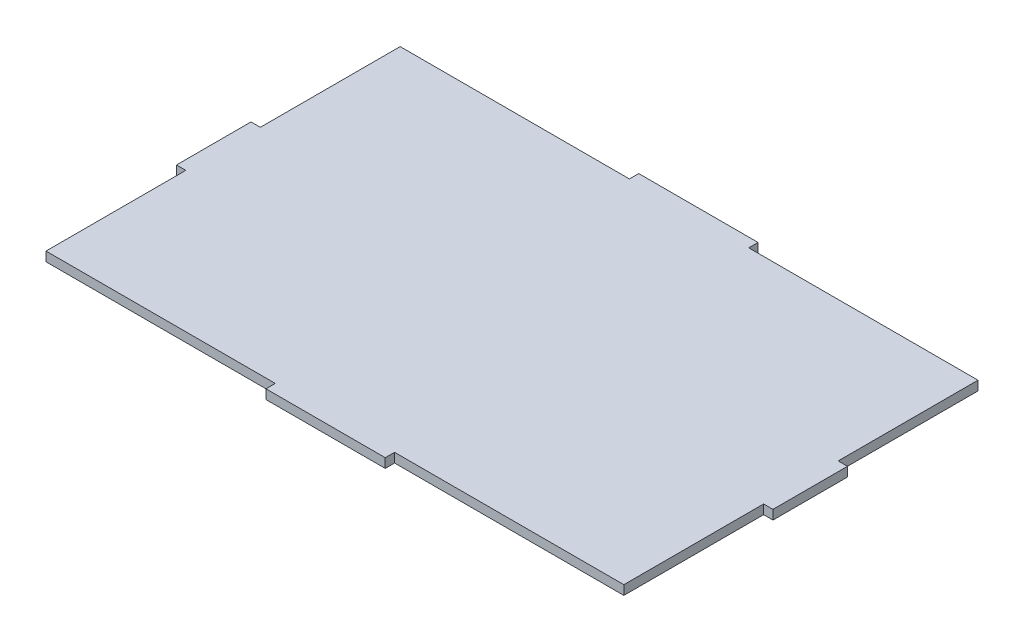
ISO-10303-21;
HEADER;
FILE_DESCRIPTION(('STEP AP214'),'2;1');
FILE_NAME('part.step','',(''),(''),'','','');
FILE_SCHEMA(('AUTOMOTIVE_DESIGN { 1 0 10303 214 1 1 1 1 }'));
ENDSEC;
DATA;
#1=APPLICATION_CONTEXT('core data for automotive mechanical design processes');
#2=APPLICATION_PROTOCOL_DEFINITION('international standard','automotive_design',2000,#1);
#3=PRODUCT_CONTEXT('',#1,'mechanical');
#4=PRODUCT('Part','Part','',(#3));
#5=PRODUCT_RELATED_PRODUCT_CATEGORY('part','',(#4));
#6=PRODUCT_DEFINITION_FORMATION('','',#4);
#7=PRODUCT_DEFINITION_CONTEXT('part definition',#1,'design');
#8=PRODUCT_DEFINITION('design','',#6,#7);
#9=PRODUCT_DEFINITION_SHAPE('','',#8);
#10=(LENGTH_UNIT() NAMED_UNIT(*) SI_UNIT(.MILLI.,.METRE.));
#11=(NAMED_UNIT(*) PLANE_ANGLE_UNIT() SI_UNIT($,.RADIAN.));
#12=(NAMED_UNIT(*) SI_UNIT($,.STERADIAN.) SOLID_ANGLE_UNIT());
#13=UNCERTAINTY_MEASURE_WITH_UNIT(LENGTH_MEASURE(1.E-05),#10,'distance_accuracy_value','');
#14=(GEOMETRIC_REPRESENTATION_CONTEXT(3) GLOBAL_UNCERTAINTY_ASSIGNED_CONTEXT((#13)) GLOBAL_UNIT_ASSIGNED_CONTEXT((#10,
#11,#12)) REPRESENTATION_CONTEXT('',''));
#15=CARTESIAN_POINT('',(0.,0.,0.));
#16=DIRECTION('',(0.,0.,1.));
#17=DIRECTION('',(1.,0.,0.));
#18=AXIS2_PLACEMENT_3D('',#15,#16,#17);
#19=CARTESIAN_POINT('',(101.6,3.175,63.5));
#20=DIRECTION('',(-1.,0.,0.));
#21=DIRECTION('',(0.,0.,1.));
#22=AXIS2_PLACEMENT_3D('',#19,#20,#21);
#23=PLANE('',#22);
#24=DIRECTION('',(0.,0.,-1.));
#25=VECTOR('',#24,1.);
#26=CARTESIAN_POINT('',(101.6,3.175,63.5));
#27=LINE('',#26,#25);
#28=CARTESIAN_POINT('',(101.6,3.175,12.7));
#29=VERTEX_POINT('',#28);
#30=CARTESIAN_POINT('',(101.6,3.175,-12.7));
#31=VERTEX_POINT('',#30);
#32=EDGE_CURVE('E315',#29,#31,#27,.T.);
#33=ORIENTED_EDGE('',*,*,#32,.F.);
#34=DIRECTION('',(0.,1.,0.));
#35=VECTOR('',#34,1.);
#36=CARTESIAN_POINT('',(101.6,0.,12.7));
#37=LINE('',#36,#35);
#38=CARTESIAN_POINT('',(101.6,0.,12.7));
#39=VERTEX_POINT('',#38);
#40=EDGE_CURVE('E277',#39,#29,#37,.T.);
#41=ORIENTED_EDGE('',*,*,#40,.F.);
#42=DIRECTION('',(0.,0.,-1.));
#43=VECTOR('',#42,1.);
#44=CARTESIAN_POINT('',(101.6,0.,63.5));
#45=LINE('',#44,#43);
#46=CARTESIAN_POINT('',(101.6,0.,-12.7));
#47=VERTEX_POINT('',#46);
#48=EDGE_CURVE('E306',#39,#47,#45,.T.);
#49=ORIENTED_EDGE('',*,*,#48,.T.);
#50=DIRECTION('',(0.,1.,0.));
#51=VECTOR('',#50,1.);
#52=CARTESIAN_POINT('',(101.6,0.,-12.7));
#53=LINE('',#52,#51);
#54=EDGE_CURVE('E307',#47,#31,#53,.T.);
#55=ORIENTED_EDGE('',*,*,#54,.T.);
#56=EDGE_LOOP('',(#33,#41,#49,#55));
#57=FACE_BOUND('',#56,.T.);
#58=ADVANCED_FACE('F33',(#57),#23,.F.);
#59=CARTESIAN_POINT('',(-101.6,3.175,-63.5));
#60=DIRECTION('',(0.,0.,1.));
#61=DIRECTION('',(1.,0.,0.));
#62=AXIS2_PLACEMENT_3D('',#59,#60,#61);
#63=PLANE('',#62);
#64=DIRECTION('',(-1.,0.,0.));
#65=VECTOR('',#64,1.);
#66=CARTESIAN_POINT('',(-101.6,0.,-63.5));
#67=LINE('',#66,#65);
#68=CARTESIAN_POINT('',(20.3199999999999,0.,-63.5));
#69=VERTEX_POINT('',#68);
#70=CARTESIAN_POINT('',(-20.32,0.,-63.5));
#71=VERTEX_POINT('',#70);
#72=EDGE_CURVE('E325',#69,#71,#67,.T.);
#73=ORIENTED_EDGE('',*,*,#72,.T.);
#74=DIRECTION('',(0.,1.,0.));
#75=VECTOR('',#74,1.);
#76=CARTESIAN_POINT('',(-20.3200000000001,0.,-63.5));
#77=LINE('',#76,#75);
#78=CARTESIAN_POINT('',(-20.3200000000001,3.175,-63.5));
#79=VERTEX_POINT('',#78);
#80=EDGE_CURVE('E181',#71,#79,#77,.T.);
#81=ORIENTED_EDGE('',*,*,#80,.T.);
#82=DIRECTION('',(-1.,0.,0.));
#83=VECTOR('',#82,1.);
#84=CARTESIAN_POINT('',(-101.6,3.175,-63.5));
#85=LINE('',#84,#83);
#86=CARTESIAN_POINT('',(20.3199999999999,3.175,-63.5));
#87=VERTEX_POINT('',#86);
#88=EDGE_CURVE('E318',#87,#79,#85,.T.);
#89=ORIENTED_EDGE('',*,*,#88,.F.);
#90=DIRECTION('',(0.,1.,0.));
#91=VECTOR('',#90,1.);
#92=CARTESIAN_POINT('',(20.3199999999999,0.,-63.5));
#93=LINE('',#92,#91);
#94=EDGE_CURVE('E304',#69,#87,#93,.T.);
#95=ORIENTED_EDGE('',*,*,#94,.F.);
#96=EDGE_LOOP('',(#73,#81,#89,#95));
#97=FACE_BOUND('',#96,.T.);
#98=ADVANCED_FACE('F370',(#97),#63,.F.);
#99=CARTESIAN_POINT('',(-101.6,3.175,63.5));
#100=DIRECTION('',(1.,0.,0.));
#101=DIRECTION('',(0.,0.,-1.));
#102=AXIS2_PLACEMENT_3D('',#99,#100,#101);
#103=PLANE('',#102);
#104=DIRECTION('',(0.,0.,1.));
#105=VECTOR('',#104,1.);
#106=CARTESIAN_POINT('',(-101.6,0.,63.5));
#107=LINE('',#106,#105);
#108=CARTESIAN_POINT('',(-101.6,0.,-12.7));
#109=VERTEX_POINT('',#108);
#110=CARTESIAN_POINT('',(-101.6,0.,12.7));
#111=VERTEX_POINT('',#110);
#112=EDGE_CURVE('E326',#109,#111,#107,.T.);
#113=ORIENTED_EDGE('',*,*,#112,.T.);
#114=DIRECTION('',(0.,1.,0.));
#115=VECTOR('',#114,1.);
#116=CARTESIAN_POINT('',(-101.6,0.,12.7));
#117=LINE('',#116,#115);
#118=CARTESIAN_POINT('',(-101.6,3.175,12.7));
#119=VERTEX_POINT('',#118);
#120=EDGE_CURVE('E230',#111,#119,#117,.T.);
#121=ORIENTED_EDGE('',*,*,#120,.T.);
#122=DIRECTION('',(0.,0.,1.));
#123=VECTOR('',#122,1.);
#124=CARTESIAN_POINT('',(-101.6,3.175,63.5));
#125=LINE('',#124,#123);
#126=CARTESIAN_POINT('',(-101.6,3.175,-12.7));
#127=VERTEX_POINT('',#126);
#128=EDGE_CURVE('E41',#127,#119,#125,.T.);
#129=ORIENTED_EDGE('',*,*,#128,.F.);
#130=DIRECTION('',(0.,1.,0.));
#131=VECTOR('',#130,1.);
#132=CARTESIAN_POINT('',(-101.6,0.,-12.7));
#133=LINE('',#132,#131);
#134=EDGE_CURVE('E216',#109,#127,#133,.T.);
#135=ORIENTED_EDGE('',*,*,#134,.F.);
#136=EDGE_LOOP('',(#113,#121,#129,#135));
#137=FACE_BOUND('',#136,.T.);
#138=ADVANCED_FACE('F360',(#137),#103,.F.);
#139=CARTESIAN_POINT('',(-101.6,3.175,63.5));
#140=DIRECTION('',(0.,0.,-1.));
#141=DIRECTION('',(-1.,0.,0.));
#142=AXIS2_PLACEMENT_3D('',#139,#140,#141);
#143=PLANE('',#142);
#144=DIRECTION('',(1.,0.,0.));
#145=VECTOR('',#144,1.);
#146=CARTESIAN_POINT('',(-101.6,0.,63.5));
#147=LINE('',#146,#145);
#148=CARTESIAN_POINT('',(-20.32,0.,63.5));
#149=VERTEX_POINT('',#148);
#150=CARTESIAN_POINT('',(20.32,0.,63.5));
#151=VERTEX_POINT('',#150);
#152=EDGE_CURVE('E36',#149,#151,#147,.T.);
#153=ORIENTED_EDGE('',*,*,#152,.T.);
#154=DIRECTION('',(0.,1.,0.));
#155=VECTOR('',#154,1.);
#156=CARTESIAN_POINT('',(20.32,0.,63.5));
#157=LINE('',#156,#155);
#158=CARTESIAN_POINT('',(20.32,3.175,63.5));
#159=VERTEX_POINT('',#158);
#160=EDGE_CURVE('E279',#151,#159,#157,.T.);
#161=ORIENTED_EDGE('',*,*,#160,.T.);
#162=DIRECTION('',(1.,0.,0.));
#163=VECTOR('',#162,1.);
#164=CARTESIAN_POINT('',(-101.6,3.175,63.5));
#165=LINE('',#164,#163);
#166=CARTESIAN_POINT('',(-20.32,3.175,63.5));
#167=VERTEX_POINT('',#166);
#168=EDGE_CURVE('E11',#167,#159,#165,.T.);
#169=ORIENTED_EDGE('',*,*,#168,.F.);
#170=DIRECTION('',(0.,1.,0.));
#171=VECTOR('',#170,1.);
#172=CARTESIAN_POINT('',(-20.32,0.,63.5));
#173=LINE('',#172,#171);
#174=EDGE_CURVE('E247',#149,#167,#173,.T.);
#175=ORIENTED_EDGE('',*,*,#174,.F.);
#176=EDGE_LOOP('',(#153,#161,#169,#175));
#177=FACE_BOUND('',#176,.T.);
#178=ADVANCED_FACE('F335',(#177),#143,.F.);
#179=CARTESIAN_POINT('',(0.,3.175,0.));
#180=DIRECTION('',(0.,-1.,0.));
#181=DIRECTION('',(0.,0.,-1.));
#182=AXIS2_PLACEMENT_3D('',#179,#180,#181);
#183=PLANE('',#182);
#184=DIRECTION('',(0.,0.,1.));
#185=VECTOR('',#184,1.);
#186=CARTESIAN_POINT('',(98.425,3.175,12.7));
#187=LINE('',#186,#185);
#188=CARTESIAN_POINT('',(98.425,3.175,12.7));
#189=VERTEX_POINT('',#188);
#190=CARTESIAN_POINT('',(98.425,3.175,60.325));
#191=VERTEX_POINT('',#190);
#192=EDGE_CURVE('E255',#189,#191,#187,.T.);
#193=ORIENTED_EDGE('',*,*,#192,.F.);
#194=DIRECTION('',(-1.,0.,0.));
#195=VECTOR('',#194,1.);
#196=CARTESIAN_POINT('',(101.6,3.175,12.7));
#197=LINE('',#196,#195);
#198=EDGE_CURVE('E269',#29,#189,#197,.T.);
#199=ORIENTED_EDGE('',*,*,#198,.F.);
#200=ORIENTED_EDGE('',*,*,#32,.T.);
#201=DIRECTION('',(1.,0.,0.));
#202=VECTOR('',#201,1.);
#203=CARTESIAN_POINT('',(98.425,3.175,-12.7));
#204=LINE('',#203,#202);
#205=CARTESIAN_POINT('',(98.425,3.175,-12.7));
#206=VERTEX_POINT('',#205);
#207=EDGE_CURVE('E287',#206,#31,#204,.T.);
#208=ORIENTED_EDGE('',*,*,#207,.F.);
#209=DIRECTION('',(0.,0.,1.));
#210=VECTOR('',#209,1.);
#211=CARTESIAN_POINT('',(98.425,3.175,-60.325));
#212=LINE('',#211,#210);
#213=CARTESIAN_POINT('',(98.425,3.175,-60.325));
#214=VERTEX_POINT('',#213);
#215=EDGE_CURVE('E300',#214,#206,#212,.T.);
#216=ORIENTED_EDGE('',*,*,#215,.F.);
#217=DIRECTION('',(1.,0.,0.));
#218=VECTOR('',#217,1.);
#219=CARTESIAN_POINT('',(20.3199999999999,3.175,-60.325));
#220=LINE('',#219,#218);
#221=CARTESIAN_POINT('',(20.3199999999999,3.175,-60.325));
#222=VERTEX_POINT('',#221);
#223=EDGE_CURVE('E297',#222,#214,#220,.T.);
#224=ORIENTED_EDGE('',*,*,#223,.F.);
#225=DIRECTION('',(0.,0.,1.));
#226=VECTOR('',#225,1.);
#227=CARTESIAN_POINT('',(20.3199999999999,3.175,-63.5));
#228=LINE('',#227,#226);
#229=EDGE_CURVE('E213',#87,#222,#228,.T.);
#230=ORIENTED_EDGE('',*,*,#229,.F.);
#231=ORIENTED_EDGE('',*,*,#88,.T.);
#232=DIRECTION('',(0.,0.,-1.));
#233=VECTOR('',#232,1.);
#234=CARTESIAN_POINT('',(-20.3200000000001,3.175,-63.5));
#235=LINE('',#234,#233);
#236=CARTESIAN_POINT('',(-20.3199999999999,3.175,-60.325));
#237=VERTEX_POINT('',#236);
#238=EDGE_CURVE('E206',#237,#79,#235,.T.);
#239=ORIENTED_EDGE('',*,*,#238,.F.);
#240=DIRECTION('',(1.,0.,0.));
#241=VECTOR('',#240,1.);
#242=CARTESIAN_POINT('',(-20.3199999999999,3.175,-60.325));
#243=LINE('',#242,#241);
#244=CARTESIAN_POINT('',(-98.4250000000001,3.175,-60.325));
#245=VERTEX_POINT('',#244);
#246=EDGE_CURVE('E178',#245,#237,#243,.T.);
#247=ORIENTED_EDGE('',*,*,#246,.F.);
#248=DIRECTION('',(0.,0.,-1.));
#249=VECTOR('',#248,1.);
#250=CARTESIAN_POINT('',(-98.4250000000001,3.175,-60.325));
#251=LINE('',#250,#249);
#252=CARTESIAN_POINT('',(-98.425,3.175,-12.7));
#253=VERTEX_POINT('',#252);
#254=EDGE_CURVE('E197',#253,#245,#251,.T.);
#255=ORIENTED_EDGE('',*,*,#254,.F.);
#256=DIRECTION('',(1.,0.,0.));
#257=VECTOR('',#256,1.);
#258=CARTESIAN_POINT('',(-98.425,3.175,-12.7));
#259=LINE('',#258,#257);
#260=EDGE_CURVE('E200',#127,#253,#259,.T.);
#261=ORIENTED_EDGE('',*,*,#260,.F.);
#262=ORIENTED_EDGE('',*,*,#128,.T.);
#263=DIRECTION('',(-1.,0.,0.));
#264=VECTOR('',#263,1.);
#265=CARTESIAN_POINT('',(-98.425,3.175,12.7));
#266=LINE('',#265,#264);
#267=CARTESIAN_POINT('',(-98.425,3.175,12.7));
#268=VERTEX_POINT('',#267);
#269=EDGE_CURVE('E231',#268,#119,#266,.T.);
#270=ORIENTED_EDGE('',*,*,#269,.F.);
#271=DIRECTION('',(0.,0.,-1.));
#272=VECTOR('',#271,1.);
#273=CARTESIAN_POINT('',(-98.425,3.175,60.325));
#274=LINE('',#273,#272);
#275=CARTESIAN_POINT('',(-98.425,3.175,60.325));
#276=VERTEX_POINT('',#275);
#277=EDGE_CURVE('E223',#276,#268,#274,.T.);
#278=ORIENTED_EDGE('',*,*,#277,.F.);
#279=DIRECTION('',(-1.,0.,0.));
#280=VECTOR('',#279,1.);
#281=CARTESIAN_POINT('',(-20.32,3.175,60.325));
#282=LINE('',#281,#280);
#283=CARTESIAN_POINT('',(-20.32,3.175,60.325));
#284=VERTEX_POINT('',#283);
#285=EDGE_CURVE('E237',#284,#276,#282,.T.);
#286=ORIENTED_EDGE('',*,*,#285,.F.);
#287=DIRECTION('',(0.,0.,-1.));
#288=VECTOR('',#287,1.);
#289=CARTESIAN_POINT('',(-20.32,3.175,63.5));
#290=LINE('',#289,#288);
#291=EDGE_CURVE('E233',#167,#284,#290,.T.);
#292=ORIENTED_EDGE('',*,*,#291,.F.);
#293=ORIENTED_EDGE('',*,*,#168,.T.);
#294=DIRECTION('',(0.,0.,1.));
#295=VECTOR('',#294,1.);
#296=CARTESIAN_POINT('',(20.32,3.175,60.325));
#297=LINE('',#296,#295);
#298=CARTESIAN_POINT('',(20.32,3.175,60.325));
#299=VERTEX_POINT('',#298);
#300=EDGE_CURVE('E267',#299,#159,#297,.T.);
#301=ORIENTED_EDGE('',*,*,#300,.F.);
#302=DIRECTION('',(-1.,0.,0.));
#303=VECTOR('',#302,1.);
#304=CARTESIAN_POINT('',(98.425,3.175,60.325));
#305=LINE('',#304,#303);
#306=EDGE_CURVE('E264',#191,#299,#305,.T.);
#307=ORIENTED_EDGE('',*,*,#306,.F.);
#308=EDGE_LOOP('',(#193,#199,#200,#208,#216,#224,#230,#231,#239,#247,#255,#261,#262,#270,#278,
#286,#292,#293,#301,#307));
#309=FACE_BOUND('',#308,.T.);
#310=ADVANCED_FACE('F345',(#309),#183,.F.);
#311=CARTESIAN_POINT('',(0.,0.,0.));
#312=DIRECTION('',(0.,-1.,0.));
#313=DIRECTION('',(0.,0.,-1.));
#314=AXIS2_PLACEMENT_3D('',#311,#312,#313);
#315=PLANE('',#314);
#316=DIRECTION('',(-1.,0.,0.));
#317=VECTOR('',#316,1.);
#318=CARTESIAN_POINT('',(101.6,0.,12.7));
#319=LINE('',#318,#317);
#320=CARTESIAN_POINT('',(98.425,0.,12.7));
#321=VERTEX_POINT('',#320);
#322=EDGE_CURVE('E258',#39,#321,#319,.T.);
#323=ORIENTED_EDGE('',*,*,#322,.T.);
#324=DIRECTION('',(0.,0.,1.));
#325=VECTOR('',#324,1.);
#326=CARTESIAN_POINT('',(98.425,0.,12.7));
#327=LINE('',#326,#325);
#328=CARTESIAN_POINT('',(98.425,0.,60.325));
#329=VERTEX_POINT('',#328);
#330=EDGE_CURVE('E260',#321,#329,#327,.T.);
#331=ORIENTED_EDGE('',*,*,#330,.T.);
#332=DIRECTION('',(-1.,0.,0.));
#333=VECTOR('',#332,1.);
#334=CARTESIAN_POINT('',(98.425,0.,60.325));
#335=LINE('',#334,#333);
#336=CARTESIAN_POINT('',(20.32,0.,60.325));
#337=VERTEX_POINT('',#336);
#338=EDGE_CURVE('E251',#329,#337,#335,.T.);
#339=ORIENTED_EDGE('',*,*,#338,.T.);
#340=DIRECTION('',(0.,0.,1.));
#341=VECTOR('',#340,1.);
#342=CARTESIAN_POINT('',(20.32,0.,60.325));
#343=LINE('',#342,#341);
#344=EDGE_CURVE('E254',#337,#151,#343,.T.);
#345=ORIENTED_EDGE('',*,*,#344,.T.);
#346=ORIENTED_EDGE('',*,*,#152,.F.);
#347=DIRECTION('',(0.,0.,-1.));
#348=VECTOR('',#347,1.);
#349=CARTESIAN_POINT('',(-20.32,0.,63.5));
#350=LINE('',#349,#348);
#351=CARTESIAN_POINT('',(-20.32,0.,60.325));
#352=VERTEX_POINT('',#351);
#353=EDGE_CURVE('E222',#149,#352,#350,.T.);
#354=ORIENTED_EDGE('',*,*,#353,.T.);
#355=DIRECTION('',(-1.,0.,0.));
#356=VECTOR('',#355,1.);
#357=CARTESIAN_POINT('',(-20.32,0.,60.325));
#358=LINE('',#357,#356);
#359=CARTESIAN_POINT('',(-98.425,0.,60.325));
#360=VERTEX_POINT('',#359);
#361=EDGE_CURVE('E49',#352,#360,#358,.T.);
#362=ORIENTED_EDGE('',*,*,#361,.T.);
#363=DIRECTION('',(0.,0.,-1.));
#364=VECTOR('',#363,1.);
#365=CARTESIAN_POINT('',(-98.425,0.,60.325));
#366=LINE('',#365,#364);
#367=CARTESIAN_POINT('',(-98.425,0.,12.7));
#368=VERTEX_POINT('',#367);
#369=EDGE_CURVE('E227',#360,#368,#366,.T.);
#370=ORIENTED_EDGE('',*,*,#369,.T.);
#371=DIRECTION('',(-1.,0.,0.));
#372=VECTOR('',#371,1.);
#373=CARTESIAN_POINT('',(-98.425,0.,12.7));
#374=LINE('',#373,#372);
#375=EDGE_CURVE('E219',#368,#111,#374,.T.);
#376=ORIENTED_EDGE('',*,*,#375,.T.);
#377=ORIENTED_EDGE('',*,*,#112,.F.);
#378=DIRECTION('',(1.,0.,0.));
#379=VECTOR('',#378,1.);
#380=CARTESIAN_POINT('',(-98.425,0.,-12.7));
#381=LINE('',#380,#379);
#382=CARTESIAN_POINT('',(-98.425,0.,-12.7));
#383=VERTEX_POINT('',#382);
#384=EDGE_CURVE('E191',#109,#383,#381,.T.);
#385=ORIENTED_EDGE('',*,*,#384,.T.);
#386=DIRECTION('',(0.,0.,-1.));
#387=VECTOR('',#386,1.);
#388=CARTESIAN_POINT('',(-98.4250000000001,0.,-60.325));
#389=LINE('',#388,#387);
#390=CARTESIAN_POINT('',(-98.4250000000001,0.,-60.325));
#391=VERTEX_POINT('',#390);
#392=EDGE_CURVE('E182',#383,#391,#389,.T.);
#393=ORIENTED_EDGE('',*,*,#392,.T.);
#394=DIRECTION('',(1.,0.,0.));
#395=VECTOR('',#394,1.);
#396=CARTESIAN_POINT('',(-20.3199999999999,0.,-60.325));
#397=LINE('',#396,#395);
#398=CARTESIAN_POINT('',(-20.3199999999999,0.,-60.325));
#399=VERTEX_POINT('',#398);
#400=EDGE_CURVE('E175',#391,#399,#397,.T.);
#401=ORIENTED_EDGE('',*,*,#400,.T.);
#402=DIRECTION('',(0.,0.,-1.));
#403=VECTOR('',#402,1.);
#404=CARTESIAN_POINT('',(-20.3200000000001,0.,-63.5));
#405=LINE('',#404,#403);
#406=EDGE_CURVE('E185',#399,#71,#405,.T.);
#407=ORIENTED_EDGE('',*,*,#406,.T.);
#408=ORIENTED_EDGE('',*,*,#72,.F.);
#409=DIRECTION('',(0.,0.,1.));
#410=VECTOR('',#409,1.);
#411=CARTESIAN_POINT('',(20.3199999999999,0.,-63.5));
#412=LINE('',#411,#410);
#413=CARTESIAN_POINT('',(20.3199999999999,0.,-60.325));
#414=VERTEX_POINT('',#413);
#415=EDGE_CURVE('E283',#69,#414,#412,.T.);
#416=ORIENTED_EDGE('',*,*,#415,.T.);
#417=DIRECTION('',(1.,0.,0.));
#418=VECTOR('',#417,1.);
#419=CARTESIAN_POINT('',(20.3199999999999,0.,-60.325));
#420=LINE('',#419,#418);
#421=CARTESIAN_POINT('',(98.425,0.,-60.325));
#422=VERTEX_POINT('',#421);
#423=EDGE_CURVE('E286',#414,#422,#420,.T.);
#424=ORIENTED_EDGE('',*,*,#423,.T.);
#425=DIRECTION('',(0.,0.,1.));
#426=VECTOR('',#425,1.);
#427=CARTESIAN_POINT('',(98.425,0.,-60.325));
#428=LINE('',#427,#426);
#429=CARTESIAN_POINT('',(98.425,0.,-12.7));
#430=VERTEX_POINT('',#429);
#431=EDGE_CURVE('E57',#422,#430,#428,.T.);
#432=ORIENTED_EDGE('',*,*,#431,.T.);
#433=DIRECTION('',(1.,0.,0.));
#434=VECTOR('',#433,1.);
#435=CARTESIAN_POINT('',(98.425,0.,-12.7));
#436=LINE('',#435,#434);
#437=EDGE_CURVE('E291',#430,#47,#436,.T.);
#438=ORIENTED_EDGE('',*,*,#437,.T.);
#439=ORIENTED_EDGE('',*,*,#48,.F.);
#440=EDGE_LOOP('',(#323,#331,#339,#345,#346,#354,#362,#370,#376,#377,#385,#393,#401,#407,#408,
#416,#424,#432,#438,#439));
#441=FACE_BOUND('',#440,.T.);
#442=ADVANCED_FACE('F194',(#441),#315,.T.);
#443=CARTESIAN_POINT('',(20.3199999999999,0.,-63.5));
#444=DIRECTION('',(-1.,0.,0.));
#445=DIRECTION('',(0.,0.,1.));
#446=AXIS2_PLACEMENT_3D('',#443,#444,#445);
#447=PLANE('',#446);
#448=ORIENTED_EDGE('',*,*,#229,.T.);
#449=DIRECTION('',(0.,1.,0.));
#450=VECTOR('',#449,1.);
#451=CARTESIAN_POINT('',(20.3199999999999,0.,-60.325));
#452=LINE('',#451,#450);
#453=EDGE_CURVE('E294',#414,#222,#452,.T.);
#454=ORIENTED_EDGE('',*,*,#453,.F.);
#455=ORIENTED_EDGE('',*,*,#415,.F.);
#456=ORIENTED_EDGE('',*,*,#94,.T.);
#457=EDGE_LOOP('',(#448,#454,#455,#456));
#458=FACE_BOUND('',#457,.T.);
#459=ADVANCED_FACE('F374',(#458),#447,.F.);
#460=CARTESIAN_POINT('',(98.425,0.,-12.7));
#461=DIRECTION('',(0.,0.,1.));
#462=DIRECTION('',(1.,0.,0.));
#463=AXIS2_PLACEMENT_3D('',#460,#461,#462);
#464=PLANE('',#463);
#465=ORIENTED_EDGE('',*,*,#207,.T.);
#466=ORIENTED_EDGE('',*,*,#54,.F.);
#467=ORIENTED_EDGE('',*,*,#437,.F.);
#468=DIRECTION('',(0.,1.,0.));
#469=VECTOR('',#468,1.);
#470=CARTESIAN_POINT('',(98.425,0.,-12.7));
#471=LINE('',#470,#469);
#472=EDGE_CURVE('E310',#430,#206,#471,.T.);
#473=ORIENTED_EDGE('',*,*,#472,.T.);
#474=EDGE_LOOP('',(#465,#466,#467,#473));
#475=FACE_BOUND('',#474,.T.);
#476=ADVANCED_FACE('F385',(#475),#464,.F.);
#477=CARTESIAN_POINT('',(98.425,0.,-60.325));
#478=DIRECTION('',(-1.,0.,0.));
#479=DIRECTION('',(0.,0.,1.));
#480=AXIS2_PLACEMENT_3D('',#477,#478,#479);
#481=PLANE('',#480);
#482=ORIENTED_EDGE('',*,*,#215,.T.);
#483=ORIENTED_EDGE('',*,*,#472,.F.);
#484=ORIENTED_EDGE('',*,*,#431,.F.);
#485=DIRECTION('',(0.,1.,0.));
#486=VECTOR('',#485,1.);
#487=CARTESIAN_POINT('',(98.425,0.,-60.325));
#488=LINE('',#487,#486);
#489=EDGE_CURVE('E312',#422,#214,#488,.T.);
#490=ORIENTED_EDGE('',*,*,#489,.T.);
#491=EDGE_LOOP('',(#482,#483,#484,#490));
#492=FACE_BOUND('',#491,.T.);
#493=ADVANCED_FACE('F379',(#492),#481,.F.);
#494=CARTESIAN_POINT('',(20.3199999999999,0.,-60.325));
#495=DIRECTION('',(0.,0.,1.));
#496=DIRECTION('',(1.,0.,0.));
#497=AXIS2_PLACEMENT_3D('',#494,#495,#496);
#498=PLANE('',#497);
#499=ORIENTED_EDGE('',*,*,#223,.T.);
#500=ORIENTED_EDGE('',*,*,#489,.F.);
#501=ORIENTED_EDGE('',*,*,#423,.F.);
#502=ORIENTED_EDGE('',*,*,#453,.T.);
#503=EDGE_LOOP('',(#499,#500,#501,#502));
#504=FACE_BOUND('',#503,.T.);
#505=ADVANCED_FACE('F377',(#504),#498,.F.);
#506=CARTESIAN_POINT('',(-20.3199999999999,0.,-60.325));
#507=DIRECTION('',(0.,0.,1.));
#508=DIRECTION('',(1.,0.,0.));
#509=AXIS2_PLACEMENT_3D('',#506,#507,#508);
#510=PLANE('',#509);
#511=ORIENTED_EDGE('',*,*,#246,.T.);
#512=DIRECTION('',(0.,1.,0.));
#513=VECTOR('',#512,1.);
#514=CARTESIAN_POINT('',(-20.3199999999999,0.,-60.325));
#515=LINE('',#514,#513);
#516=EDGE_CURVE('E171',#399,#237,#515,.T.);
#517=ORIENTED_EDGE('',*,*,#516,.F.);
#518=ORIENTED_EDGE('',*,*,#400,.F.);
#519=DIRECTION('',(0.,1.,0.));
#520=VECTOR('',#519,1.);
#521=CARTESIAN_POINT('',(-98.4250000000001,0.,-60.325));
#522=LINE('',#521,#520);
#523=EDGE_CURVE('E211',#391,#245,#522,.T.);
#524=ORIENTED_EDGE('',*,*,#523,.T.);
#525=EDGE_LOOP('',(#511,#517,#518,#524));
#526=FACE_BOUND('',#525,.T.);
#527=ADVANCED_FACE('F173',(#526),#510,.F.);
#528=CARTESIAN_POINT('',(-98.4250000000001,0.,-60.325));
#529=DIRECTION('',(1.,0.,0.));
#530=DIRECTION('',(0.,0.,-1.));
#531=AXIS2_PLACEMENT_3D('',#528,#529,#530);
#532=PLANE('',#531);
#533=ORIENTED_EDGE('',*,*,#254,.T.);
#534=ORIENTED_EDGE('',*,*,#523,.F.);
#535=ORIENTED_EDGE('',*,*,#392,.F.);
#536=DIRECTION('',(0.,1.,0.));
#537=VECTOR('',#536,1.);
#538=CARTESIAN_POINT('',(-98.425,0.,-12.7));
#539=LINE('',#538,#537);
#540=EDGE_CURVE('E214',#383,#253,#539,.T.);
#541=ORIENTED_EDGE('',*,*,#540,.T.);
#542=EDGE_LOOP('',(#533,#534,#535,#541));
#543=FACE_BOUND('',#542,.T.);
#544=ADVANCED_FACE('F366',(#543),#532,.F.);
#545=CARTESIAN_POINT('',(-98.425,0.,-12.7));
#546=DIRECTION('',(0.,0.,1.));
#547=DIRECTION('',(1.,0.,0.));
#548=AXIS2_PLACEMENT_3D('',#545,#546,#547);
#549=PLANE('',#548);
#550=ORIENTED_EDGE('',*,*,#260,.T.);
#551=ORIENTED_EDGE('',*,*,#540,.F.);
#552=ORIENTED_EDGE('',*,*,#384,.F.);
#553=ORIENTED_EDGE('',*,*,#134,.T.);
#554=EDGE_LOOP('',(#550,#551,#552,#553));
#555=FACE_BOUND('',#554,.T.);
#556=ADVANCED_FACE('F364',(#555),#549,.F.);
#557=CARTESIAN_POINT('',(-20.3200000000001,0.,-63.5));
#558=DIRECTION('',(1.,0.,0.));
#559=DIRECTION('',(0.,0.,-1.));
#560=AXIS2_PLACEMENT_3D('',#557,#558,#559);
#561=PLANE('',#560);
#562=ORIENTED_EDGE('',*,*,#238,.T.);
#563=ORIENTED_EDGE('',*,*,#80,.F.);
#564=ORIENTED_EDGE('',*,*,#406,.F.);
#565=ORIENTED_EDGE('',*,*,#516,.T.);
#566=EDGE_LOOP('',(#562,#563,#564,#565));
#567=FACE_BOUND('',#566,.T.);
#568=ADVANCED_FACE('F186',(#567),#561,.F.);
#569=CARTESIAN_POINT('',(-98.425,0.,12.7));
#570=DIRECTION('',(0.,0.,-1.));
#571=DIRECTION('',(-1.,0.,0.));
#572=AXIS2_PLACEMENT_3D('',#569,#570,#571);
#573=PLANE('',#572);
#574=ORIENTED_EDGE('',*,*,#269,.T.);
#575=ORIENTED_EDGE('',*,*,#120,.F.);
#576=ORIENTED_EDGE('',*,*,#375,.F.);
#577=DIRECTION('',(0.,1.,0.));
#578=VECTOR('',#577,1.);
#579=CARTESIAN_POINT('',(-98.425,0.,12.7));
#580=LINE('',#579,#578);
#581=EDGE_CURVE('E207',#368,#268,#580,.T.);
#582=ORIENTED_EDGE('',*,*,#581,.T.);
#583=EDGE_LOOP('',(#574,#575,#576,#582));
#584=FACE_BOUND('',#583,.T.);
#585=ADVANCED_FACE('F358',(#584),#573,.F.);
#586=CARTESIAN_POINT('',(-98.425,0.,60.325));
#587=DIRECTION('',(1.,0.,0.));
#588=DIRECTION('',(0.,0.,-1.));
#589=AXIS2_PLACEMENT_3D('',#586,#587,#588);
#590=PLANE('',#589);
#591=ORIENTED_EDGE('',*,*,#277,.T.);
#592=ORIENTED_EDGE('',*,*,#581,.F.);
#593=ORIENTED_EDGE('',*,*,#369,.F.);
#594=DIRECTION('',(0.,1.,0.));
#595=VECTOR('',#594,1.);
#596=CARTESIAN_POINT('',(-98.425,0.,60.325));
#597=LINE('',#596,#595);
#598=EDGE_CURVE('E243',#360,#276,#597,.T.);
#599=ORIENTED_EDGE('',*,*,#598,.T.);
#600=EDGE_LOOP('',(#591,#592,#593,#599));
#601=FACE_BOUND('',#600,.T.);
#602=ADVANCED_FACE('F355',(#601),#590,.F.);
#603=CARTESIAN_POINT('',(-20.32,0.,60.325));
#604=DIRECTION('',(0.,0.,-1.));
#605=DIRECTION('',(-1.,0.,0.));
#606=AXIS2_PLACEMENT_3D('',#603,#604,#605);
#607=PLANE('',#606);
#608=ORIENTED_EDGE('',*,*,#285,.T.);
#609=ORIENTED_EDGE('',*,*,#598,.F.);
#610=ORIENTED_EDGE('',*,*,#361,.F.);
#611=DIRECTION('',(0.,1.,0.));
#612=VECTOR('',#611,1.);
#613=CARTESIAN_POINT('',(-20.32,0.,60.325));
#614=LINE('',#613,#612);
#615=EDGE_CURVE('E245',#352,#284,#614,.T.);
#616=ORIENTED_EDGE('',*,*,#615,.T.);
#617=EDGE_LOOP('',(#608,#609,#610,#616));
#618=FACE_BOUND('',#617,.T.);
#619=ADVANCED_FACE('F351',(#618),#607,.F.);
#620=CARTESIAN_POINT('',(-20.32,0.,63.5));
#621=DIRECTION('',(1.,0.,0.));
#622=DIRECTION('',(0.,0.,-1.));
#623=AXIS2_PLACEMENT_3D('',#620,#621,#622);
#624=PLANE('',#623);
#625=ORIENTED_EDGE('',*,*,#291,.T.);
#626=ORIENTED_EDGE('',*,*,#615,.F.);
#627=ORIENTED_EDGE('',*,*,#353,.F.);
#628=ORIENTED_EDGE('',*,*,#174,.T.);
#629=EDGE_LOOP('',(#625,#626,#627,#628));
#630=FACE_BOUND('',#629,.T.);
#631=ADVANCED_FACE('F350',(#630),#624,.F.);
#632=CARTESIAN_POINT('',(98.425,0.,60.325));
#633=DIRECTION('',(0.,0.,-1.));
#634=DIRECTION('',(-1.,0.,0.));
#635=AXIS2_PLACEMENT_3D('',#632,#633,#634);
#636=PLANE('',#635);
#637=ORIENTED_EDGE('',*,*,#306,.T.);
#638=DIRECTION('',(0.,1.,0.));
#639=VECTOR('',#638,1.);
#640=CARTESIAN_POINT('',(20.32,0.,60.325));
#641=LINE('',#640,#639);
#642=EDGE_CURVE('E263',#337,#299,#641,.T.);
#643=ORIENTED_EDGE('',*,*,#642,.F.);
#644=ORIENTED_EDGE('',*,*,#338,.F.);
#645=DIRECTION('',(0.,1.,0.));
#646=VECTOR('',#645,1.);
#647=CARTESIAN_POINT('',(98.425,0.,60.325));
#648=LINE('',#647,#646);
#649=EDGE_CURVE('E234',#329,#191,#648,.T.);
#650=ORIENTED_EDGE('',*,*,#649,.T.);
#651=EDGE_LOOP('',(#637,#643,#644,#650));
#652=FACE_BOUND('',#651,.T.);
#653=ADVANCED_FACE('F395',(#652),#636,.F.);
#654=CARTESIAN_POINT('',(98.425,0.,12.7));
#655=DIRECTION('',(-1.,0.,0.));
#656=DIRECTION('',(0.,0.,1.));
#657=AXIS2_PLACEMENT_3D('',#654,#655,#656);
#658=PLANE('',#657);
#659=ORIENTED_EDGE('',*,*,#192,.T.);
#660=ORIENTED_EDGE('',*,*,#649,.F.);
#661=ORIENTED_EDGE('',*,*,#330,.F.);
#662=DIRECTION('',(0.,1.,0.));
#663=VECTOR('',#662,1.);
#664=CARTESIAN_POINT('',(98.425,0.,12.7));
#665=LINE('',#664,#663);
#666=EDGE_CURVE('E275',#321,#189,#665,.T.);
#667=ORIENTED_EDGE('',*,*,#666,.T.);
#668=EDGE_LOOP('',(#659,#660,#661,#667));
#669=FACE_BOUND('',#668,.T.);
#670=ADVANCED_FACE('F393',(#669),#658,.F.);
#671=CARTESIAN_POINT('',(101.6,0.,12.7));
#672=DIRECTION('',(0.,0.,-1.));
#673=DIRECTION('',(-1.,0.,0.));
#674=AXIS2_PLACEMENT_3D('',#671,#672,#673);
#675=PLANE('',#674);
#676=ORIENTED_EDGE('',*,*,#198,.T.);
#677=ORIENTED_EDGE('',*,*,#666,.F.);
#678=ORIENTED_EDGE('',*,*,#322,.F.);
#679=ORIENTED_EDGE('',*,*,#40,.T.);
#680=EDGE_LOOP('',(#676,#677,#678,#679));
#681=FACE_BOUND('',#680,.T.);
#682=ADVANCED_FACE('F391',(#681),#675,.F.);
#683=CARTESIAN_POINT('',(20.32,0.,60.325));
#684=DIRECTION('',(-1.,0.,0.));
#685=DIRECTION('',(0.,0.,1.));
#686=AXIS2_PLACEMENT_3D('',#683,#684,#685);
#687=PLANE('',#686);
#688=ORIENTED_EDGE('',*,*,#300,.T.);
#689=ORIENTED_EDGE('',*,*,#160,.F.);
#690=ORIENTED_EDGE('',*,*,#344,.F.);
#691=ORIENTED_EDGE('',*,*,#642,.T.);
#692=EDGE_LOOP('',(#688,#689,#690,#691));
#693=FACE_BOUND('',#692,.T.);
#694=ADVANCED_FACE('F340',(#693),#687,.F.);
#695=CLOSED_SHELL('',(#58,#98,#138,#178,#310,#442,#459,#476,#493,#505,#527,#544,#556,#568,#585,
#602,#619,#631,#653,#670,#682,#694));
#696=MANIFOLD_SOLID_BREP('B2',#695);
#697=ADVANCED_BREP_SHAPE_REPRESENTATION('',(#18,#696),#14);
#698=SHAPE_DEFINITION_REPRESENTATION(#9,#697);
ENDSEC;
END-ISO-10303-21;
